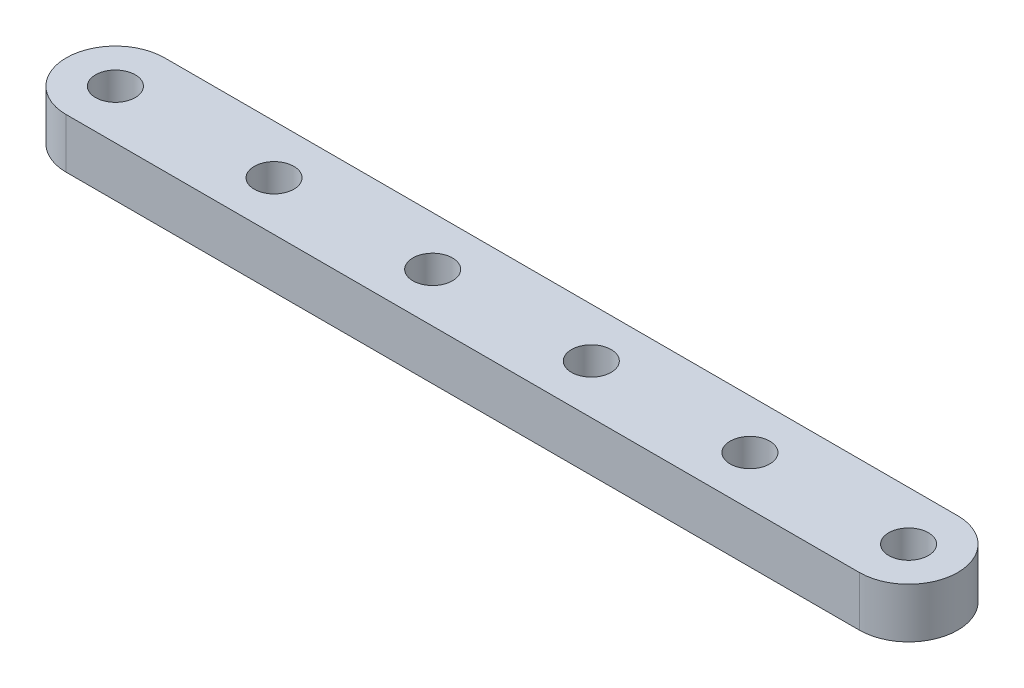
ISO-10303-21;
HEADER;
FILE_DESCRIPTION(('STEP AP214'),'2;1');
FILE_NAME('part.step','',(''),(''),'','','');
FILE_SCHEMA(('AUTOMOTIVE_DESIGN { 1 0 10303 214 1 1 1 1 }'));
ENDSEC;
DATA;
#1=APPLICATION_CONTEXT('core data for automotive mechanical design processes');
#2=APPLICATION_PROTOCOL_DEFINITION('international standard','automotive_design',2000,#1);
#3=PRODUCT_CONTEXT('',#1,'mechanical');
#4=PRODUCT('Part','Part','',(#3));
#5=PRODUCT_RELATED_PRODUCT_CATEGORY('part','',(#4));
#6=PRODUCT_DEFINITION_FORMATION('','',#4);
#7=PRODUCT_DEFINITION_CONTEXT('part definition',#1,'design');
#8=PRODUCT_DEFINITION('design','',#6,#7);
#9=PRODUCT_DEFINITION_SHAPE('','',#8);
#10=(LENGTH_UNIT() NAMED_UNIT(*) SI_UNIT(.MILLI.,.METRE.));
#11=(NAMED_UNIT(*) PLANE_ANGLE_UNIT() SI_UNIT($,.RADIAN.));
#12=(NAMED_UNIT(*) SI_UNIT($,.STERADIAN.) SOLID_ANGLE_UNIT());
#13=UNCERTAINTY_MEASURE_WITH_UNIT(LENGTH_MEASURE(1.E-05),#10,'distance_accuracy_value','');
#14=(GEOMETRIC_REPRESENTATION_CONTEXT(3) GLOBAL_UNCERTAINTY_ASSIGNED_CONTEXT((#13)) GLOBAL_UNIT_ASSIGNED_CONTEXT((#10,
#11,#12)) REPRESENTATION_CONTEXT('',''));
#15=CARTESIAN_POINT('',(0.,0.,0.));
#16=DIRECTION('',(0.,0.,1.));
#17=DIRECTION('',(1.,0.,0.));
#18=AXIS2_PLACEMENT_3D('',#15,#16,#17);
#19=CARTESIAN_POINT('',(24.13,0.,0.));
#20=DIRECTION('',(0.,1.,0.));
#21=DIRECTION('',(0.,0.,1.));
#22=AXIS2_PLACEMENT_3D('',#19,#20,#21);
#23=PLANE('',#22);
#24=CARTESIAN_POINT('',(25.4,0.,0.));
#25=DIRECTION('',(0.,1.,0.));
#26=DIRECTION('',(0.,0.,1.));
#27=AXIS2_PLACEMENT_3D('',#24,#25,#26);
#28=CIRCLE('',#27,1.27);
#29=CARTESIAN_POINT('',(25.4,0.,1.27));
#30=VERTEX_POINT('',#29);
#31=EDGE_CURVE('E97',#30,#30,#28,.T.);
#32=ORIENTED_EDGE('',*,*,#31,.T.);
#33=EDGE_LOOP('',(#32));
#34=FACE_BOUND('',#33,.T.);
#35=CARTESIAN_POINT('',(15.24,0.,0.));
#36=DIRECTION('',(0.,1.,0.));
#37=DIRECTION('',(0.,0.,1.));
#38=AXIS2_PLACEMENT_3D('',#35,#36,#37);
#39=CIRCLE('',#38,1.27);
#40=CARTESIAN_POINT('',(15.24,0.,1.27));
#41=VERTEX_POINT('',#40);
#42=EDGE_CURVE('E100',#41,#41,#39,.T.);
#43=ORIENTED_EDGE('',*,*,#42,.T.);
#44=EDGE_LOOP('',(#43));
#45=FACE_BOUND('',#44,.T.);
#46=CARTESIAN_POINT('',(5.08000000000002,0.,0.));
#47=DIRECTION('',(0.,1.,0.));
#48=DIRECTION('',(0.,0.,1.));
#49=AXIS2_PLACEMENT_3D('',#46,#47,#48);
#50=CIRCLE('',#49,1.27);
#51=CARTESIAN_POINT('',(5.08000000000002,0.,1.27));
#52=VERTEX_POINT('',#51);
#53=EDGE_CURVE('E114',#52,#52,#50,.T.);
#54=ORIENTED_EDGE('',*,*,#53,.T.);
#55=EDGE_LOOP('',(#54));
#56=FACE_BOUND('',#55,.T.);
#57=CARTESIAN_POINT('',(-5.07999999999999,0.,0.));
#58=DIRECTION('',(0.,1.,0.));
#59=DIRECTION('',(0.,0.,1.));
#60=AXIS2_PLACEMENT_3D('',#57,#58,#59);
#61=CIRCLE('',#60,1.27);
#62=CARTESIAN_POINT('',(-5.07999999999999,0.,1.27));
#63=VERTEX_POINT('',#62);
#64=EDGE_CURVE('E111',#63,#63,#61,.T.);
#65=ORIENTED_EDGE('',*,*,#64,.T.);
#66=EDGE_LOOP('',(#65));
#67=FACE_BOUND('',#66,.T.);
#68=CARTESIAN_POINT('',(-15.24,0.,0.));
#69=DIRECTION('',(0.,1.,0.));
#70=DIRECTION('',(0.,0.,1.));
#71=AXIS2_PLACEMENT_3D('',#68,#69,#70);
#72=CIRCLE('',#71,1.27);
#73=CARTESIAN_POINT('',(-15.24,0.,1.27));
#74=VERTEX_POINT('',#73);
#75=EDGE_CURVE('E108',#74,#74,#72,.T.);
#76=ORIENTED_EDGE('',*,*,#75,.T.);
#77=EDGE_LOOP('',(#76));
#78=FACE_BOUND('',#77,.T.);
#79=CARTESIAN_POINT('',(-25.4,0.,0.));
#80=DIRECTION('',(0.,1.,0.));
#81=DIRECTION('',(0.,0.,1.));
#82=AXIS2_PLACEMENT_3D('',#79,#80,#81);
#83=CIRCLE('',#82,1.27);
#84=CARTESIAN_POINT('',(-25.4,0.,1.27));
#85=VERTEX_POINT('',#84);
#86=EDGE_CURVE('E104',#85,#85,#83,.T.);
#87=ORIENTED_EDGE('',*,*,#86,.T.);
#88=EDGE_LOOP('',(#87));
#89=FACE_BOUND('',#88,.T.);
#90=CARTESIAN_POINT('',(-25.4,0.,0.));
#91=DIRECTION('',(0.,1.,0.));
#92=DIRECTION('',(0.,0.,1.));
#93=AXIS2_PLACEMENT_3D('',#90,#91,#92);
#94=CIRCLE('',#93,3.1496);
#95=CARTESIAN_POINT('',(-25.4,0.,-3.1496));
#96=VERTEX_POINT('',#95);
#97=CARTESIAN_POINT('',(-25.4,0.,3.1496));
#98=VERTEX_POINT('',#97);
#99=EDGE_CURVE('E96',#96,#98,#94,.T.);
#100=ORIENTED_EDGE('',*,*,#99,.F.);
#101=DIRECTION('',(-1.,0.,0.));
#102=VECTOR('',#101,1.);
#103=CARTESIAN_POINT('',(-25.4,0.,-3.1496));
#104=LINE('',#103,#102);
#105=CARTESIAN_POINT('',(25.4,0.,-3.1496));
#106=VERTEX_POINT('',#105);
#107=EDGE_CURVE('E81',#106,#96,#104,.T.);
#108=ORIENTED_EDGE('',*,*,#107,.F.);
#109=CARTESIAN_POINT('',(25.4,0.,0.));
#110=DIRECTION('',(0.,1.,0.));
#111=DIRECTION('',(0.,0.,1.));
#112=AXIS2_PLACEMENT_3D('',#109,#110,#111);
#113=CIRCLE('',#112,3.1496);
#114=CARTESIAN_POINT('',(25.4,0.,3.1496));
#115=VERTEX_POINT('',#114);
#116=EDGE_CURVE('E89',#115,#106,#113,.T.);
#117=ORIENTED_EDGE('',*,*,#116,.F.);
#118=DIRECTION('',(1.,0.,0.));
#119=VECTOR('',#118,1.);
#120=CARTESIAN_POINT('',(-25.4,0.,3.1496));
#121=LINE('',#120,#119);
#122=EDGE_CURVE('E94',#98,#115,#121,.T.);
#123=ORIENTED_EDGE('',*,*,#122,.F.);
#124=EDGE_LOOP('',(#100,#108,#117,#123));
#125=FACE_BOUND('',#124,.T.);
#126=ADVANCED_FACE('F39',(#34,#45,#56,#67,#78,#89,#125),#23,.F.);
#127=CARTESIAN_POINT('',(-25.4,3.2,0.));
#128=DIRECTION('',(0.,-1.,0.));
#129=DIRECTION('',(0.,0.,-1.));
#130=AXIS2_PLACEMENT_3D('',#127,#128,#129);
#131=CYLINDRICAL_SURFACE('',#130,3.1496);
#132=DIRECTION('',(0.,-1.,0.));
#133=VECTOR('',#132,1.);
#134=CARTESIAN_POINT('',(-25.4,3.2,-3.1496));
#135=LINE('',#134,#133);
#136=CARTESIAN_POINT('',(-25.4,3.2,-3.1496));
#137=VERTEX_POINT('',#136);
#138=EDGE_CURVE('E59',#137,#96,#135,.T.);
#139=ORIENTED_EDGE('',*,*,#138,.T.);
#140=ORIENTED_EDGE('',*,*,#99,.T.);
#141=DIRECTION('',(0.,-1.,0.));
#142=VECTOR('',#141,1.);
#143=CARTESIAN_POINT('',(-25.4,3.2,3.1496));
#144=LINE('',#143,#142);
#145=CARTESIAN_POINT('',(-25.4,3.2,3.1496));
#146=VERTEX_POINT('',#145);
#147=EDGE_CURVE('E11',#146,#98,#144,.T.);
#148=ORIENTED_EDGE('',*,*,#147,.F.);
#149=CARTESIAN_POINT('',(-25.4,3.2,0.));
#150=DIRECTION('',(0.,1.,0.));
#151=DIRECTION('',(0.,0.,1.));
#152=AXIS2_PLACEMENT_3D('',#149,#150,#151);
#153=CIRCLE('',#152,3.1496);
#154=EDGE_CURVE('E121',#137,#146,#153,.T.);
#155=ORIENTED_EDGE('',*,*,#154,.F.);
#156=EDGE_LOOP('',(#139,#140,#148,#155));
#157=FACE_BOUND('',#156,.T.);
#158=ADVANCED_FACE('F145',(#157),#131,.T.);
#159=CARTESIAN_POINT('',(0.,3.2,3.1496));
#160=DIRECTION('',(0.,0.,-1.));
#161=DIRECTION('',(-1.,0.,0.));
#162=AXIS2_PLACEMENT_3D('',#159,#160,#161);
#163=PLANE('',#162);
#164=ORIENTED_EDGE('',*,*,#147,.T.);
#165=ORIENTED_EDGE('',*,*,#122,.T.);
#166=DIRECTION('',(0.,-1.,0.));
#167=VECTOR('',#166,1.);
#168=CARTESIAN_POINT('',(25.4,3.2,3.1496));
#169=LINE('',#168,#167);
#170=CARTESIAN_POINT('',(25.4,3.2,3.1496));
#171=VERTEX_POINT('',#170);
#172=EDGE_CURVE('E46',#171,#115,#169,.T.);
#173=ORIENTED_EDGE('',*,*,#172,.F.);
#174=DIRECTION('',(1.,0.,0.));
#175=VECTOR('',#174,1.);
#176=CARTESIAN_POINT('',(0.,3.2,3.1496));
#177=LINE('',#176,#175);
#178=EDGE_CURVE('E124',#146,#171,#177,.T.);
#179=ORIENTED_EDGE('',*,*,#178,.F.);
#180=EDGE_LOOP('',(#164,#165,#173,#179));
#181=FACE_BOUND('',#180,.T.);
#182=ADVANCED_FACE('F149',(#181),#163,.F.);
#183=CARTESIAN_POINT('',(25.4,3.2,0.));
#184=DIRECTION('',(0.,-1.,0.));
#185=DIRECTION('',(0.,0.,-1.));
#186=AXIS2_PLACEMENT_3D('',#183,#184,#185);
#187=CYLINDRICAL_SURFACE('',#186,3.1496);
#188=ORIENTED_EDGE('',*,*,#172,.T.);
#189=ORIENTED_EDGE('',*,*,#116,.T.);
#190=DIRECTION('',(0.,-1.,0.));
#191=VECTOR('',#190,1.);
#192=CARTESIAN_POINT('',(25.4,3.2,-3.1496));
#193=LINE('',#192,#191);
#194=CARTESIAN_POINT('',(25.4,3.2,-3.1496));
#195=VERTEX_POINT('',#194);
#196=EDGE_CURVE('E77',#195,#106,#193,.T.);
#197=ORIENTED_EDGE('',*,*,#196,.F.);
#198=CARTESIAN_POINT('',(25.4,3.2,0.));
#199=DIRECTION('',(0.,1.,0.));
#200=DIRECTION('',(0.,0.,1.));
#201=AXIS2_PLACEMENT_3D('',#198,#199,#200);
#202=CIRCLE('',#201,3.1496);
#203=EDGE_CURVE('E126',#171,#195,#202,.T.);
#204=ORIENTED_EDGE('',*,*,#203,.F.);
#205=EDGE_LOOP('',(#188,#189,#197,#204));
#206=FACE_BOUND('',#205,.T.);
#207=ADVANCED_FACE('F90',(#206),#187,.T.);
#208=CARTESIAN_POINT('',(-5.07999999999999,3.2,0.));
#209=DIRECTION('',(0.,-1.,0.));
#210=DIRECTION('',(0.,0.,-1.));
#211=AXIS2_PLACEMENT_3D('',#208,#209,#210);
#212=CYLINDRICAL_SURFACE('',#211,1.27);
#213=CARTESIAN_POINT('',(-5.07999999999999,3.2,0.));
#214=DIRECTION('',(0.,1.,0.));
#215=DIRECTION('',(0.,0.,1.));
#216=AXIS2_PLACEMENT_3D('',#213,#214,#215);
#217=CIRCLE('',#216,1.27);
#218=CARTESIAN_POINT('',(-5.07999999999999,3.2,1.27));
#219=VERTEX_POINT('',#218);
#220=EDGE_CURVE('E138',#219,#219,#217,.T.);
#221=ORIENTED_EDGE('',*,*,#220,.T.);
#222=EDGE_LOOP('',(#221));
#223=FACE_BOUND('',#222,.T.);
#224=ORIENTED_EDGE('',*,*,#64,.F.);
#225=EDGE_LOOP('',(#224));
#226=FACE_BOUND('',#225,.T.);
#227=ADVANCED_FACE('F157',(#223,#226),#212,.F.);
#228=CARTESIAN_POINT('',(5.08000000000002,3.2,0.));
#229=DIRECTION('',(0.,-1.,0.));
#230=DIRECTION('',(0.,0.,-1.));
#231=AXIS2_PLACEMENT_3D('',#228,#229,#230);
#232=CYLINDRICAL_SURFACE('',#231,1.27);
#233=CARTESIAN_POINT('',(5.08000000000002,3.2,0.));
#234=DIRECTION('',(0.,1.,0.));
#235=DIRECTION('',(0.,0.,1.));
#236=AXIS2_PLACEMENT_3D('',#233,#234,#235);
#237=CIRCLE('',#236,1.27);
#238=CARTESIAN_POINT('',(5.08000000000002,3.2,1.27));
#239=VERTEX_POINT('',#238);
#240=EDGE_CURVE('E135',#239,#239,#237,.T.);
#241=ORIENTED_EDGE('',*,*,#240,.T.);
#242=EDGE_LOOP('',(#241));
#243=FACE_BOUND('',#242,.T.);
#244=ORIENTED_EDGE('',*,*,#53,.F.);
#245=EDGE_LOOP('',(#244));
#246=FACE_BOUND('',#245,.T.);
#247=ADVANCED_FACE('F197',(#243,#246),#232,.F.);
#248=CARTESIAN_POINT('',(15.24,3.2,0.));
#249=DIRECTION('',(0.,-1.,0.));
#250=DIRECTION('',(0.,0.,-1.));
#251=AXIS2_PLACEMENT_3D('',#248,#249,#250);
#252=CYLINDRICAL_SURFACE('',#251,1.27);
#253=CARTESIAN_POINT('',(15.24,3.2,0.));
#254=DIRECTION('',(0.,1.,0.));
#255=DIRECTION('',(0.,0.,1.));
#256=AXIS2_PLACEMENT_3D('',#253,#254,#255);
#257=CIRCLE('',#256,1.27);
#258=CARTESIAN_POINT('',(15.24,3.2,1.27));
#259=VERTEX_POINT('',#258);
#260=EDGE_CURVE('E132',#259,#259,#257,.T.);
#261=ORIENTED_EDGE('',*,*,#260,.T.);
#262=EDGE_LOOP('',(#261));
#263=FACE_BOUND('',#262,.T.);
#264=ORIENTED_EDGE('',*,*,#42,.F.);
#265=EDGE_LOOP('',(#264));
#266=FACE_BOUND('',#265,.T.);
#267=ADVANCED_FACE('F201',(#263,#266),#252,.F.);
#268=CARTESIAN_POINT('',(25.4,3.2,0.));
#269=DIRECTION('',(0.,-1.,0.));
#270=DIRECTION('',(0.,0.,-1.));
#271=AXIS2_PLACEMENT_3D('',#268,#269,#270);
#272=CYLINDRICAL_SURFACE('',#271,1.27);
#273=CARTESIAN_POINT('',(25.4,3.2,0.));
#274=DIRECTION('',(0.,1.,0.));
#275=DIRECTION('',(0.,0.,1.));
#276=AXIS2_PLACEMENT_3D('',#273,#274,#275);
#277=CIRCLE('',#276,1.27);
#278=CARTESIAN_POINT('',(25.4,3.2,1.27));
#279=VERTEX_POINT('',#278);
#280=EDGE_CURVE('E129',#279,#279,#277,.T.);
#281=ORIENTED_EDGE('',*,*,#280,.T.);
#282=EDGE_LOOP('',(#281));
#283=FACE_BOUND('',#282,.T.);
#284=ORIENTED_EDGE('',*,*,#31,.F.);
#285=EDGE_LOOP('',(#284));
#286=FACE_BOUND('',#285,.T.);
#287=ADVANCED_FACE('F186',(#283,#286),#272,.F.);
#288=CARTESIAN_POINT('',(0.,3.2,-3.1496));
#289=DIRECTION('',(0.,0.,-1.));
#290=DIRECTION('',(-1.,0.,0.));
#291=AXIS2_PLACEMENT_3D('',#288,#289,#290);
#292=PLANE('',#291);
#293=ORIENTED_EDGE('',*,*,#196,.T.);
#294=ORIENTED_EDGE('',*,*,#107,.T.);
#295=ORIENTED_EDGE('',*,*,#138,.F.);
#296=DIRECTION('',(1.,0.,0.));
#297=VECTOR('',#296,1.);
#298=CARTESIAN_POINT('',(0.,3.2,-3.1496));
#299=LINE('',#298,#297);
#300=EDGE_CURVE('E84',#137,#195,#299,.T.);
#301=ORIENTED_EDGE('',*,*,#300,.T.);
#302=EDGE_LOOP('',(#293,#294,#295,#301));
#303=FACE_BOUND('',#302,.T.);
#304=ADVANCED_FACE('F79',(#303),#292,.T.);
#305=CARTESIAN_POINT('',(-25.4,3.2,0.));
#306=DIRECTION('',(0.,-1.,0.));
#307=DIRECTION('',(0.,0.,-1.));
#308=AXIS2_PLACEMENT_3D('',#305,#306,#307);
#309=CYLINDRICAL_SURFACE('',#308,1.27);
#310=CARTESIAN_POINT('',(-25.4,3.2,0.));
#311=DIRECTION('',(0.,1.,0.));
#312=DIRECTION('',(0.,0.,1.));
#313=AXIS2_PLACEMENT_3D('',#310,#311,#312);
#314=CIRCLE('',#313,1.27);
#315=CARTESIAN_POINT('',(-25.4,3.2,1.27));
#316=VERTEX_POINT('',#315);
#317=EDGE_CURVE('E107',#316,#316,#314,.T.);
#318=ORIENTED_EDGE('',*,*,#317,.T.);
#319=EDGE_LOOP('',(#318));
#320=FACE_BOUND('',#319,.T.);
#321=ORIENTED_EDGE('',*,*,#86,.F.);
#322=EDGE_LOOP('',(#321));
#323=FACE_BOUND('',#322,.T.);
#324=ADVANCED_FACE('F176',(#320,#323),#309,.F.);
#325=CARTESIAN_POINT('',(-15.24,3.2,0.));
#326=DIRECTION('',(0.,-1.,0.));
#327=DIRECTION('',(0.,0.,-1.));
#328=AXIS2_PLACEMENT_3D('',#325,#326,#327);
#329=CYLINDRICAL_SURFACE('',#328,1.27);
#330=CARTESIAN_POINT('',(-15.24,3.2,0.));
#331=DIRECTION('',(0.,1.,0.));
#332=DIRECTION('',(0.,0.,1.));
#333=AXIS2_PLACEMENT_3D('',#330,#331,#332);
#334=CIRCLE('',#333,1.27);
#335=CARTESIAN_POINT('',(-15.24,3.2,1.27));
#336=VERTEX_POINT('',#335);
#337=EDGE_CURVE('E141',#336,#336,#334,.T.);
#338=ORIENTED_EDGE('',*,*,#337,.T.);
#339=EDGE_LOOP('',(#338));
#340=FACE_BOUND('',#339,.T.);
#341=ORIENTED_EDGE('',*,*,#75,.F.);
#342=EDGE_LOOP('',(#341));
#343=FACE_BOUND('',#342,.T.);
#344=ADVANCED_FACE('F178',(#340,#343),#329,.F.);
#345=CARTESIAN_POINT('',(0.,3.2,0.));
#346=DIRECTION('',(0.,1.,0.));
#347=DIRECTION('',(0.,0.,1.));
#348=AXIS2_PLACEMENT_3D('',#345,#346,#347);
#349=PLANE('',#348);
#350=ORIENTED_EDGE('',*,*,#317,.F.);
#351=EDGE_LOOP('',(#350));
#352=FACE_BOUND('',#351,.T.);
#353=ORIENTED_EDGE('',*,*,#154,.T.);
#354=ORIENTED_EDGE('',*,*,#178,.T.);
#355=ORIENTED_EDGE('',*,*,#203,.T.);
#356=ORIENTED_EDGE('',*,*,#300,.F.);
#357=EDGE_LOOP('',(#353,#354,#355,#356));
#358=FACE_BOUND('',#357,.T.);
#359=ORIENTED_EDGE('',*,*,#280,.F.);
#360=EDGE_LOOP('',(#359));
#361=FACE_BOUND('',#360,.T.);
#362=ORIENTED_EDGE('',*,*,#260,.F.);
#363=EDGE_LOOP('',(#362));
#364=FACE_BOUND('',#363,.T.);
#365=ORIENTED_EDGE('',*,*,#240,.F.);
#366=EDGE_LOOP('',(#365));
#367=FACE_BOUND('',#366,.T.);
#368=ORIENTED_EDGE('',*,*,#220,.F.);
#369=EDGE_LOOP('',(#368));
#370=FACE_BOUND('',#369,.T.);
#371=ORIENTED_EDGE('',*,*,#337,.F.);
#372=EDGE_LOOP('',(#371));
#373=FACE_BOUND('',#372,.T.);
#374=ADVANCED_FACE('F147',(#352,#358,#361,#364,#367,#370,#373),#349,.T.);
#375=CLOSED_SHELL('',(#126,#158,#182,#207,#227,#247,#267,#287,#304,#324,#344,#374));
#376=MANIFOLD_SOLID_BREP('B2',#375);
#377=ADVANCED_BREP_SHAPE_REPRESENTATION('',(#18,#376),#14);
#378=SHAPE_DEFINITION_REPRESENTATION(#9,#377);
ENDSEC;
END-ISO-10303-21;
